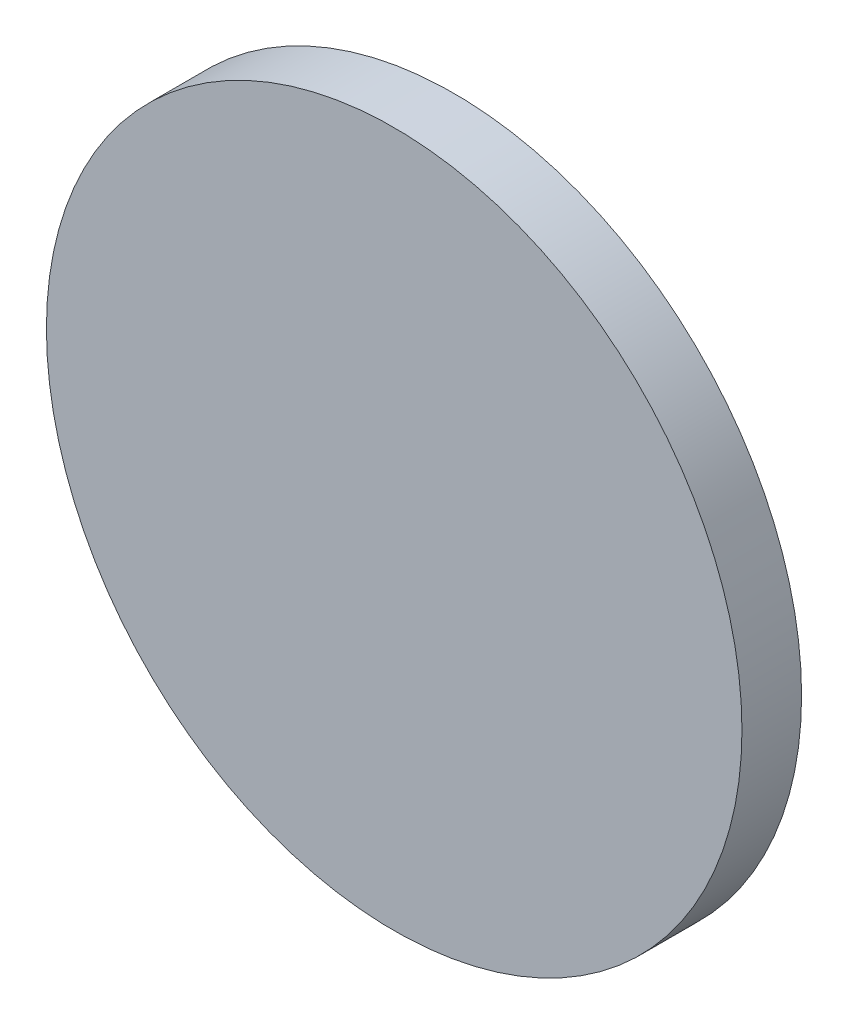
ISO-10303-21;
HEADER;
FILE_DESCRIPTION(('STEP AP214'),'2;1');
FILE_NAME('part.step','',(''),(''),'','','');
FILE_SCHEMA(('AUTOMOTIVE_DESIGN { 1 0 10303 214 1 1 1 1 }'));
ENDSEC;
DATA;
#1=APPLICATION_CONTEXT('core data for automotive mechanical design processes');
#2=APPLICATION_PROTOCOL_DEFINITION('international standard','automotive_design',2000,#1);
#3=PRODUCT_CONTEXT('',#1,'mechanical');
#4=PRODUCT('Part','Part','',(#3));
#5=PRODUCT_RELATED_PRODUCT_CATEGORY('part','',(#4));
#6=PRODUCT_DEFINITION_FORMATION('','',#4);
#7=PRODUCT_DEFINITION_CONTEXT('part definition',#1,'design');
#8=PRODUCT_DEFINITION('design','',#6,#7);
#9=PRODUCT_DEFINITION_SHAPE('','',#8);
#10=(LENGTH_UNIT() NAMED_UNIT(*) SI_UNIT(.MILLI.,.METRE.));
#11=(NAMED_UNIT(*) PLANE_ANGLE_UNIT() SI_UNIT($,.RADIAN.));
#12=(NAMED_UNIT(*) SI_UNIT($,.STERADIAN.) SOLID_ANGLE_UNIT());
#13=UNCERTAINTY_MEASURE_WITH_UNIT(LENGTH_MEASURE(1.E-05),#10,'distance_accuracy_value','');
#14=(GEOMETRIC_REPRESENTATION_CONTEXT(3) GLOBAL_UNCERTAINTY_ASSIGNED_CONTEXT((#13)) GLOBAL_UNIT_ASSIGNED_CONTEXT((#10,
#11,#12)) REPRESENTATION_CONTEXT('',''));
#15=CARTESIAN_POINT('',(0.,0.,0.));
#16=DIRECTION('',(0.,0.,1.));
#17=DIRECTION('',(1.,0.,0.));
#18=AXIS2_PLACEMENT_3D('',#15,#16,#17);
#19=CARTESIAN_POINT('',(11.401,9.241000014875,0.76487));
#20=DIRECTION('',(0.,0.,-1.));
#21=DIRECTION('',(-1.,0.,0.));
#22=AXIS2_PLACEMENT_3D('',#19,#20,#21);
#23=PLANE('',#22);
#24=CARTESIAN_POINT('',(11.401,9.241000014875,0.76487));
#25=DIRECTION('',(0.,0.,1.));
#26=DIRECTION('',(1.,0.,0.));
#27=AXIS2_PLACEMENT_3D('',#24,#25,#26);
#28=CIRCLE('',#27,0.200024667);
#29=CARTESIAN_POINT('',(11.601024667,9.241000014875,0.76487));
#30=VERTEX_POINT('',#29);
#31=EDGE_CURVE('E18',#30,#30,#28,.T.);
#32=ORIENTED_EDGE('',*,*,#31,.F.);
#33=EDGE_LOOP('',(#32));
#34=FACE_BOUND('',#33,.T.);
#35=ADVANCED_FACE('F15',(#34),#23,.T.);
#36=CARTESIAN_POINT('',(11.401,9.241000014875,0.76487));
#37=DIRECTION('',(0.,0.,1.));
#38=DIRECTION('',(1.,0.,0.));
#39=AXIS2_PLACEMENT_3D('',#36,#37,#38);
#40=CYLINDRICAL_SURFACE('',#39,0.200024667);
#41=CARTESIAN_POINT('',(11.401,9.241000014875,0.79916));
#42=DIRECTION('',(0.,0.,1.));
#43=DIRECTION('',(1.,0.,0.));
#44=AXIS2_PLACEMENT_3D('',#41,#42,#43);
#45=CIRCLE('',#44,0.200024667);
#46=CARTESIAN_POINT('',(11.601024667,9.241000014875,0.79916));
#47=VERTEX_POINT('',#46);
#48=EDGE_CURVE('E10',#47,#47,#45,.T.);
#49=ORIENTED_EDGE('',*,*,#48,.F.);
#50=EDGE_LOOP('',(#49));
#51=FACE_BOUND('',#50,.T.);
#52=ORIENTED_EDGE('',*,*,#31,.T.);
#53=EDGE_LOOP('',(#52));
#54=FACE_BOUND('',#53,.T.);
#55=ADVANCED_FACE('F27',(#51,#54),#40,.T.);
#56=CARTESIAN_POINT('',(11.401,9.241000014875,0.79916));
#57=DIRECTION('',(0.,0.,1.));
#58=DIRECTION('',(1.,0.,0.));
#59=AXIS2_PLACEMENT_3D('',#56,#57,#58);
#60=PLANE('',#59);
#61=ORIENTED_EDGE('',*,*,#48,.T.);
#62=EDGE_LOOP('',(#61));
#63=FACE_BOUND('',#62,.T.);
#64=ADVANCED_FACE('F34',(#63),#60,.T.);
#65=CLOSED_SHELL('',(#35,#55,#64));
#66=MANIFOLD_SOLID_BREP('B1',#65);
#67=ADVANCED_BREP_SHAPE_REPRESENTATION('',(#18,#66),#14);
#68=SHAPE_DEFINITION_REPRESENTATION(#9,#67);
ENDSEC;
END-ISO-10303-21;
